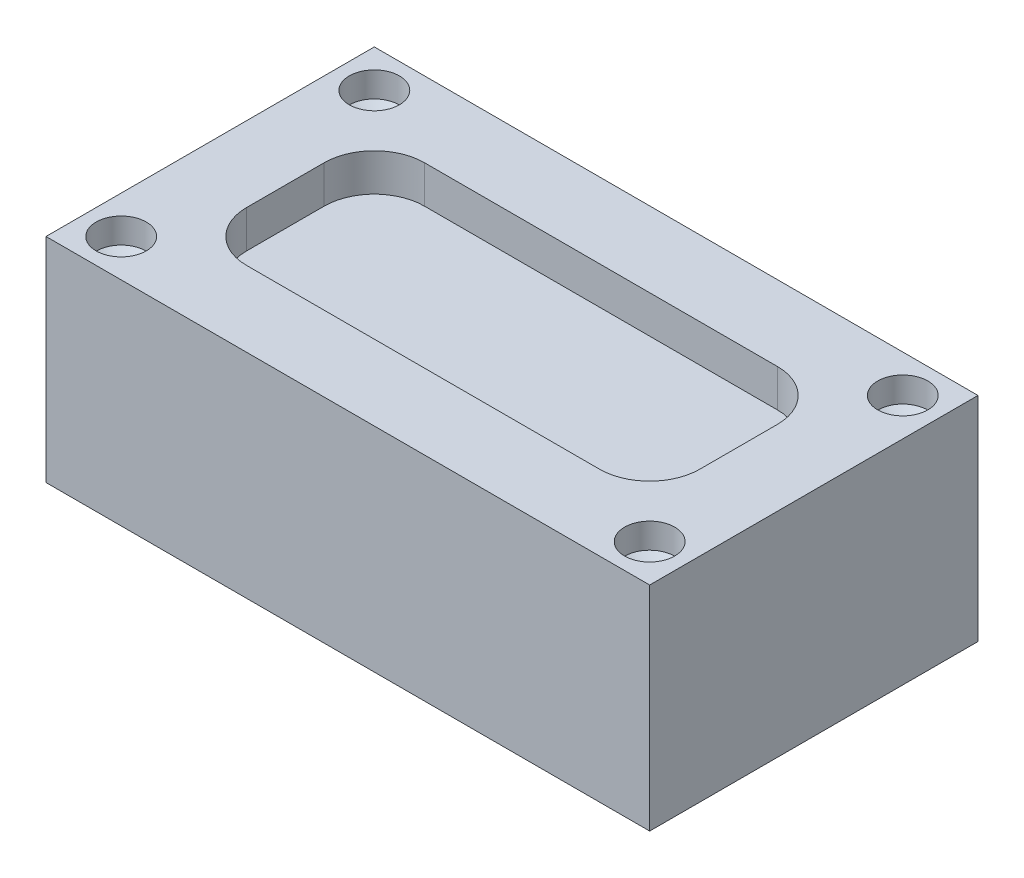
ISO-10303-21;
HEADER;
FILE_DESCRIPTION(('STEP AP214'),'2;1');
FILE_NAME('part.step','',(''),(''),'','','');
FILE_SCHEMA(('AUTOMOTIVE_DESIGN { 1 0 10303 214 1 1 1 1 }'));
ENDSEC;
DATA;
#1=APPLICATION_CONTEXT('core data for automotive mechanical design processes');
#2=APPLICATION_PROTOCOL_DEFINITION('international standard','automotive_design',2000,#1);
#3=PRODUCT_CONTEXT('',#1,'mechanical');
#4=PRODUCT('Part','Part','',(#3));
#5=PRODUCT_RELATED_PRODUCT_CATEGORY('part','',(#4));
#6=PRODUCT_DEFINITION_FORMATION('','',#4);
#7=PRODUCT_DEFINITION_CONTEXT('part definition',#1,'design');
#8=PRODUCT_DEFINITION('design','',#6,#7);
#9=PRODUCT_DEFINITION_SHAPE('','',#8);
#10=(LENGTH_UNIT() NAMED_UNIT(*) SI_UNIT(.MILLI.,.METRE.));
#11=(NAMED_UNIT(*) PLANE_ANGLE_UNIT() SI_UNIT($,.RADIAN.));
#12=(NAMED_UNIT(*) SI_UNIT($,.STERADIAN.) SOLID_ANGLE_UNIT());
#13=UNCERTAINTY_MEASURE_WITH_UNIT(LENGTH_MEASURE(1.E-05),#10,'distance_accuracy_value','');
#14=(GEOMETRIC_REPRESENTATION_CONTEXT(3) GLOBAL_UNCERTAINTY_ASSIGNED_CONTEXT((#13)) GLOBAL_UNIT_ASSIGNED_CONTEXT((#10,
#11,#12)) REPRESENTATION_CONTEXT('',''));
#15=CARTESIAN_POINT('',(0.,0.,0.));
#16=DIRECTION('',(0.,0.,1.));
#17=DIRECTION('',(1.,0.,0.));
#18=AXIS2_PLACEMENT_3D('',#15,#16,#17);
#19=CARTESIAN_POINT('',(120.382671357333,85.,65.4738352375261));
#20=DIRECTION('',(-1.,0.,0.));
#21=DIRECTION('',(0.,0.,1.));
#22=AXIS2_PLACEMENT_3D('',#19,#20,#21);
#23=PLANE('',#22);
#24=DIRECTION('',(0.,0.,-1.));
#25=VECTOR('',#24,1.);
#26=CARTESIAN_POINT('',(120.382671357333,0.,65.4738352375261));
#27=LINE('',#26,#25);
#28=CARTESIAN_POINT('',(120.382671357333,0.,65.4738352375261));
#29=VERTEX_POINT('',#28);
#30=CARTESIAN_POINT('',(120.382671357333,0.,-65.4738352375261));
#31=VERTEX_POINT('',#30);
#32=EDGE_CURVE('E181',#29,#31,#27,.T.);
#33=ORIENTED_EDGE('',*,*,#32,.T.);
#34=DIRECTION('',(0.,-1.,0.));
#35=VECTOR('',#34,1.);
#36=CARTESIAN_POINT('',(120.382671357333,85.,-65.4738352375261));
#37=LINE('',#36,#35);
#38=CARTESIAN_POINT('',(120.382671357333,85.,-65.4738352375261));
#39=VERTEX_POINT('',#38);
#40=EDGE_CURVE('E217',#39,#31,#37,.T.);
#41=ORIENTED_EDGE('',*,*,#40,.F.);
#42=DIRECTION('',(0.,0.,-1.));
#43=VECTOR('',#42,1.);
#44=CARTESIAN_POINT('',(120.382671357333,85.,65.4738352375261));
#45=LINE('',#44,#43);
#46=CARTESIAN_POINT('',(120.382671357333,85.,65.4738352375261));
#47=VERTEX_POINT('',#46);
#48=EDGE_CURVE('E191',#47,#39,#45,.T.);
#49=ORIENTED_EDGE('',*,*,#48,.F.);
#50=DIRECTION('',(0.,-1.,0.));
#51=VECTOR('',#50,1.);
#52=CARTESIAN_POINT('',(120.382671357333,85.,65.4738352375261));
#53=LINE('',#52,#51);
#54=EDGE_CURVE('E201',#47,#29,#53,.T.);
#55=ORIENTED_EDGE('',*,*,#54,.T.);
#56=EDGE_LOOP('',(#33,#41,#49,#55));
#57=FACE_BOUND('',#56,.T.);
#58=ADVANCED_FACE('F36',(#57),#23,.F.);
#59=CARTESIAN_POINT('',(-120.382671357333,85.,-65.4738352375261));
#60=DIRECTION('',(0.,0.,1.));
#61=DIRECTION('',(1.,0.,0.));
#62=AXIS2_PLACEMENT_3D('',#59,#60,#61);
#63=PLANE('',#62);
#64=DIRECTION('',(-1.,0.,0.));
#65=VECTOR('',#64,1.);
#66=CARTESIAN_POINT('',(-120.382671357333,0.,-65.4738352375261));
#67=LINE('',#66,#65);
#68=CARTESIAN_POINT('',(-120.382671357333,0.,-65.4738352375261));
#69=VERTEX_POINT('',#68);
#70=EDGE_CURVE('E204',#31,#69,#67,.T.);
#71=ORIENTED_EDGE('',*,*,#70,.T.);
#72=DIRECTION('',(0.,-1.,0.));
#73=VECTOR('',#72,1.);
#74=CARTESIAN_POINT('',(-120.382671357333,85.,-65.4738352375261));
#75=LINE('',#74,#73);
#76=CARTESIAN_POINT('',(-120.382671357333,85.,-65.4738352375261));
#77=VERTEX_POINT('',#76);
#78=EDGE_CURVE('E214',#77,#69,#75,.T.);
#79=ORIENTED_EDGE('',*,*,#78,.F.);
#80=DIRECTION('',(-1.,0.,0.));
#81=VECTOR('',#80,1.);
#82=CARTESIAN_POINT('',(-120.382671357333,85.,-65.4738352375261));
#83=LINE('',#82,#81);
#84=EDGE_CURVE('E194',#39,#77,#83,.T.);
#85=ORIENTED_EDGE('',*,*,#84,.F.);
#86=ORIENTED_EDGE('',*,*,#40,.T.);
#87=EDGE_LOOP('',(#71,#79,#85,#86));
#88=FACE_BOUND('',#87,.T.);
#89=ADVANCED_FACE('F292',(#88),#63,.F.);
#90=CARTESIAN_POINT('',(-120.382671357333,85.,65.4738352375261));
#91=DIRECTION('',(1.,0.,0.));
#92=DIRECTION('',(0.,0.,-1.));
#93=AXIS2_PLACEMENT_3D('',#90,#91,#92);
#94=PLANE('',#93);
#95=DIRECTION('',(0.,0.,1.));
#96=VECTOR('',#95,1.);
#97=CARTESIAN_POINT('',(-120.382671357333,0.,65.4738352375261));
#98=LINE('',#97,#96);
#99=CARTESIAN_POINT('',(-120.382671357333,0.,65.4738352375261));
#100=VERTEX_POINT('',#99);
#101=EDGE_CURVE('E206',#69,#100,#98,.T.);
#102=ORIENTED_EDGE('',*,*,#101,.T.);
#103=DIRECTION('',(0.,-1.,0.));
#104=VECTOR('',#103,1.);
#105=CARTESIAN_POINT('',(-120.382671357333,85.,65.4738352375261));
#106=LINE('',#105,#104);
#107=CARTESIAN_POINT('',(-120.382671357333,85.,65.4738352375261));
#108=VERTEX_POINT('',#107);
#109=EDGE_CURVE('E211',#108,#100,#106,.T.);
#110=ORIENTED_EDGE('',*,*,#109,.F.);
#111=DIRECTION('',(0.,0.,1.));
#112=VECTOR('',#111,1.);
#113=CARTESIAN_POINT('',(-120.382671357333,85.,65.4738352375261));
#114=LINE('',#113,#112);
#115=EDGE_CURVE('E197',#77,#108,#114,.T.);
#116=ORIENTED_EDGE('',*,*,#115,.F.);
#117=ORIENTED_EDGE('',*,*,#78,.T.);
#118=EDGE_LOOP('',(#102,#110,#116,#117));
#119=FACE_BOUND('',#118,.T.);
#120=ADVANCED_FACE('F298',(#119),#94,.F.);
#121=CARTESIAN_POINT('',(-120.382671357333,85.,65.4738352375261));
#122=DIRECTION('',(0.,0.,-1.));
#123=DIRECTION('',(-1.,0.,0.));
#124=AXIS2_PLACEMENT_3D('',#121,#122,#123);
#125=PLANE('',#124);
#126=DIRECTION('',(1.,0.,0.));
#127=VECTOR('',#126,1.);
#128=CARTESIAN_POINT('',(-120.382671357333,0.,65.4738352375261));
#129=LINE('',#128,#127);
#130=EDGE_CURVE('E195',#100,#29,#129,.T.);
#131=ORIENTED_EDGE('',*,*,#130,.T.);
#132=ORIENTED_EDGE('',*,*,#54,.F.);
#133=DIRECTION('',(1.,0.,0.));
#134=VECTOR('',#133,1.);
#135=CARTESIAN_POINT('',(-120.382671357333,85.,65.4738352375261));
#136=LINE('',#135,#134);
#137=EDGE_CURVE('E199',#108,#47,#136,.T.);
#138=ORIENTED_EDGE('',*,*,#137,.F.);
#139=ORIENTED_EDGE('',*,*,#109,.T.);
#140=EDGE_LOOP('',(#131,#132,#138,#139));
#141=FACE_BOUND('',#140,.T.);
#142=ADVANCED_FACE('F304',(#141),#125,.F.);
#143=CARTESIAN_POINT('',(0.,85.,0.));
#144=DIRECTION('',(0.,-1.,0.));
#145=DIRECTION('',(0.,0.,-1.));
#146=AXIS2_PLACEMENT_3D('',#143,#144,#145);
#147=PLANE('',#146);
#148=CARTESIAN_POINT('',(-105.382671357333,85.,-50.4738352375261));
#149=DIRECTION('',(0.,1.,0.));
#150=DIRECTION('',(0.,0.,1.));
#151=AXIS2_PLACEMENT_3D('',#148,#149,#150);
#152=CIRCLE('',#151,9.99999999999999);
#153=CARTESIAN_POINT('',(-105.382671357333,85.,-40.4738352375262));
#154=VERTEX_POINT('',#153);
#155=EDGE_CURVE('E145',#154,#154,#152,.T.);
#156=ORIENTED_EDGE('',*,*,#155,.F.);
#157=EDGE_LOOP('',(#156));
#158=FACE_BOUND('',#157,.T.);
#159=CARTESIAN_POINT('',(-105.382671357333,85.,50.4738352375261));
#160=DIRECTION('',(0.,1.,0.));
#161=DIRECTION('',(0.,0.,1.));
#162=AXIS2_PLACEMENT_3D('',#159,#160,#161);
#163=CIRCLE('',#162,9.99999999999999);
#164=CARTESIAN_POINT('',(-105.382671357333,85.,60.4738352375261));
#165=VERTEX_POINT('',#164);
#166=EDGE_CURVE('E144',#165,#165,#163,.T.);
#167=ORIENTED_EDGE('',*,*,#166,.F.);
#168=EDGE_LOOP('',(#167));
#169=FACE_BOUND('',#168,.T.);
#170=CARTESIAN_POINT('',(105.382671357333,85.,-50.4738352375261));
#171=DIRECTION('',(0.,1.,0.));
#172=DIRECTION('',(0.,0.,1.));
#173=AXIS2_PLACEMENT_3D('',#170,#171,#172);
#174=CIRCLE('',#173,9.99999999999999);
#175=CARTESIAN_POINT('',(105.382671357333,85.,-40.4738352375262));
#176=VERTEX_POINT('',#175);
#177=EDGE_CURVE('E155',#176,#176,#174,.T.);
#178=ORIENTED_EDGE('',*,*,#177,.F.);
#179=EDGE_LOOP('',(#178));
#180=FACE_BOUND('',#179,.T.);
#181=CARTESIAN_POINT('',(105.382671357333,85.,50.4738352375261));
#182=DIRECTION('',(0.,1.,0.));
#183=DIRECTION('',(0.,0.,1.));
#184=AXIS2_PLACEMENT_3D('',#181,#182,#183);
#185=CIRCLE('',#184,9.99999999999999);
#186=CARTESIAN_POINT('',(105.382671357333,85.,60.4738352375261));
#187=VERTEX_POINT('',#186);
#188=EDGE_CURVE('E161',#187,#187,#185,.T.);
#189=ORIENTED_EDGE('',*,*,#188,.F.);
#190=EDGE_LOOP('',(#189));
#191=FACE_BOUND('',#190,.T.);
#192=DIRECTION('',(0.,0.,-1.));
#193=VECTOR('',#192,1.);
#194=CARTESIAN_POINT('',(90.3826713573335,85.,35.4738352375261));
#195=LINE('',#194,#193);
#196=CARTESIAN_POINT('',(90.3826713573335,85.,15.4738352375261));
#197=VERTEX_POINT('',#196);
#198=CARTESIAN_POINT('',(90.3826713573335,85.,-15.4738352375261));
#199=VERTEX_POINT('',#198);
#200=EDGE_CURVE('E184',#197,#199,#195,.T.);
#201=ORIENTED_EDGE('',*,*,#200,.F.);
#202=CARTESIAN_POINT('',(70.3826713573335,85.,15.4738352375261));
#203=DIRECTION('',(0.,-1.,0.));
#204=DIRECTION('',(0.,0.,-1.));
#205=AXIS2_PLACEMENT_3D('',#202,#203,#204);
#206=CIRCLE('',#205,20.);
#207=CARTESIAN_POINT('',(70.3826713573335,85.,35.4738352375261));
#208=VERTEX_POINT('',#207);
#209=EDGE_CURVE('E249',#197,#208,#206,.T.);
#210=ORIENTED_EDGE('',*,*,#209,.T.);
#211=DIRECTION('',(1.,0.,0.));
#212=VECTOR('',#211,1.);
#213=CARTESIAN_POINT('',(-90.3826713573335,85.,35.4738352375261));
#214=LINE('',#213,#212);
#215=CARTESIAN_POINT('',(-70.3826713573335,85.,35.4738352375261));
#216=VERTEX_POINT('',#215);
#217=EDGE_CURVE('E167',#216,#208,#214,.T.);
#218=ORIENTED_EDGE('',*,*,#217,.F.);
#219=CARTESIAN_POINT('',(-70.3826713573335,85.,15.4738352375261));
#220=DIRECTION('',(0.,-1.,0.));
#221=DIRECTION('',(0.,0.,-1.));
#222=AXIS2_PLACEMENT_3D('',#219,#220,#221);
#223=CIRCLE('',#222,20.);
#224=CARTESIAN_POINT('',(-90.3826713573335,85.,15.4738352375261));
#225=VERTEX_POINT('',#224);
#226=EDGE_CURVE('E247',#216,#225,#223,.T.);
#227=ORIENTED_EDGE('',*,*,#226,.T.);
#228=DIRECTION('',(0.,0.,1.));
#229=VECTOR('',#228,1.);
#230=CARTESIAN_POINT('',(-90.3826713573335,85.,-35.4738352375261));
#231=LINE('',#230,#229);
#232=CARTESIAN_POINT('',(-90.3826713573335,85.,-15.4738352375261));
#233=VERTEX_POINT('',#232);
#234=EDGE_CURVE('E172',#233,#225,#231,.T.);
#235=ORIENTED_EDGE('',*,*,#234,.F.);
#236=CARTESIAN_POINT('',(-70.3826713573335,85.,-15.4738352375261));
#237=DIRECTION('',(0.,-1.,0.));
#238=DIRECTION('',(0.,0.,-1.));
#239=AXIS2_PLACEMENT_3D('',#236,#237,#238);
#240=CIRCLE('',#239,20.);
#241=CARTESIAN_POINT('',(-70.3826713573335,85.,-35.4738352375261));
#242=VERTEX_POINT('',#241);
#243=EDGE_CURVE('E11',#233,#242,#240,.T.);
#244=ORIENTED_EDGE('',*,*,#243,.T.);
#245=DIRECTION('',(-1.,0.,0.));
#246=VECTOR('',#245,1.);
#247=CARTESIAN_POINT('',(90.3826713573335,85.,-35.4738352375261));
#248=LINE('',#247,#246);
#249=CARTESIAN_POINT('',(70.3826713573335,85.,-35.4738352375261));
#250=VERTEX_POINT('',#249);
#251=EDGE_CURVE('E187',#250,#242,#248,.T.);
#252=ORIENTED_EDGE('',*,*,#251,.F.);
#253=CARTESIAN_POINT('',(70.3826713573335,85.,-15.4738352375261));
#254=DIRECTION('',(0.,-1.,0.));
#255=DIRECTION('',(0.,0.,-1.));
#256=AXIS2_PLACEMENT_3D('',#253,#254,#255);
#257=CIRCLE('',#256,20.);
#258=EDGE_CURVE('E44',#250,#199,#257,.T.);
#259=ORIENTED_EDGE('',*,*,#258,.T.);
#260=EDGE_LOOP('',(#201,#210,#218,#227,#235,#244,#252,#259));
#261=FACE_BOUND('',#260,.T.);
#262=ORIENTED_EDGE('',*,*,#48,.T.);
#263=ORIENTED_EDGE('',*,*,#84,.T.);
#264=ORIENTED_EDGE('',*,*,#115,.T.);
#265=ORIENTED_EDGE('',*,*,#137,.T.);
#266=EDGE_LOOP('',(#262,#263,#264,#265));
#267=FACE_BOUND('',#266,.T.);
#268=ADVANCED_FACE('F251',(#158,#169,#180,#191,#261,#267),#147,.F.);
#269=CARTESIAN_POINT('',(0.,0.,0.));
#270=DIRECTION('',(0.,-1.,0.));
#271=DIRECTION('',(0.,0.,-1.));
#272=AXIS2_PLACEMENT_3D('',#269,#270,#271);
#273=PLANE('',#272);
#274=ORIENTED_EDGE('',*,*,#32,.F.);
#275=ORIENTED_EDGE('',*,*,#130,.F.);
#276=ORIENTED_EDGE('',*,*,#101,.F.);
#277=ORIENTED_EDGE('',*,*,#70,.F.);
#278=EDGE_LOOP('',(#274,#275,#276,#277));
#279=FACE_BOUND('',#278,.T.);
#280=ADVANCED_FACE('F309',(#279),#273,.T.);
#281=CARTESIAN_POINT('',(-90.3826713573335,70.,35.4738352375261));
#282=DIRECTION('',(0.,0.,1.));
#283=DIRECTION('',(1.,0.,0.));
#284=AXIS2_PLACEMENT_3D('',#281,#282,#283);
#285=PLANE('',#284);
#286=DIRECTION('',(1.,0.,0.));
#287=VECTOR('',#286,1.);
#288=CARTESIAN_POINT('',(-90.3826713573335,70.,35.4738352375261));
#289=LINE('',#288,#287);
#290=CARTESIAN_POINT('',(-70.3826713573335,70.,35.4738352375261));
#291=VERTEX_POINT('',#290);
#292=CARTESIAN_POINT('',(70.3826713573335,70.,35.4738352375261));
#293=VERTEX_POINT('',#292);
#294=EDGE_CURVE('E168',#291,#293,#289,.T.);
#295=ORIENTED_EDGE('',*,*,#294,.F.);
#296=DIRECTION('',(0.,1.,0.));
#297=VECTOR('',#296,1.);
#298=CARTESIAN_POINT('',(-70.3826713573335,85.,35.4738352375261));
#299=LINE('',#298,#297);
#300=EDGE_CURVE('E222',#291,#216,#299,.T.);
#301=ORIENTED_EDGE('',*,*,#300,.T.);
#302=ORIENTED_EDGE('',*,*,#217,.T.);
#303=DIRECTION('',(0.,1.,0.));
#304=VECTOR('',#303,1.);
#305=CARTESIAN_POINT('',(70.3826713573335,70.,35.4738352375261));
#306=LINE('',#305,#304);
#307=EDGE_CURVE('E220',#208,#293,#306,.F.);
#308=ORIENTED_EDGE('',*,*,#307,.T.);
#309=EDGE_LOOP('',(#295,#301,#302,#308));
#310=FACE_BOUND('',#309,.T.);
#311=ADVANCED_FACE('F279',(#310),#285,.F.);
#312=CARTESIAN_POINT('',(-90.3826713573335,70.,-35.4738352375261));
#313=DIRECTION('',(-1.,0.,0.));
#314=DIRECTION('',(0.,0.,1.));
#315=AXIS2_PLACEMENT_3D('',#312,#313,#314);
#316=PLANE('',#315);
#317=ORIENTED_EDGE('',*,*,#234,.T.);
#318=DIRECTION('',(0.,1.,0.));
#319=VECTOR('',#318,1.);
#320=CARTESIAN_POINT('',(-90.3826713573335,70.,15.4738352375261));
#321=LINE('',#320,#319);
#322=CARTESIAN_POINT('',(-90.3826713573335,70.,15.4738352375261));
#323=VERTEX_POINT('',#322);
#324=EDGE_CURVE('E228',#225,#323,#321,.F.);
#325=ORIENTED_EDGE('',*,*,#324,.T.);
#326=DIRECTION('',(0.,0.,1.));
#327=VECTOR('',#326,1.);
#328=CARTESIAN_POINT('',(-90.3826713573335,70.,-35.4738352375261));
#329=LINE('',#328,#327);
#330=CARTESIAN_POINT('',(-90.3826713573335,70.,-15.4738352375261));
#331=VERTEX_POINT('',#330);
#332=EDGE_CURVE('E178',#331,#323,#329,.T.);
#333=ORIENTED_EDGE('',*,*,#332,.F.);
#334=DIRECTION('',(0.,1.,0.));
#335=VECTOR('',#334,1.);
#336=CARTESIAN_POINT('',(-90.3826713573335,85.,-15.4738352375261));
#337=LINE('',#336,#335);
#338=EDGE_CURVE('E225',#331,#233,#337,.T.);
#339=ORIENTED_EDGE('',*,*,#338,.T.);
#340=EDGE_LOOP('',(#317,#325,#333,#339));
#341=FACE_BOUND('',#340,.T.);
#342=ADVANCED_FACE('F271',(#341),#316,.F.);
#343=CARTESIAN_POINT('',(90.3826713573335,70.,-35.4738352375261));
#344=DIRECTION('',(0.,0.,-1.));
#345=DIRECTION('',(-1.,0.,0.));
#346=AXIS2_PLACEMENT_3D('',#343,#344,#345);
#347=PLANE('',#346);
#348=DIRECTION('',(-1.,0.,0.));
#349=VECTOR('',#348,1.);
#350=CARTESIAN_POINT('',(90.3826713573335,70.,-35.4738352375261));
#351=LINE('',#350,#349);
#352=CARTESIAN_POINT('',(70.3826713573335,70.,-35.4738352375261));
#353=VERTEX_POINT('',#352);
#354=CARTESIAN_POINT('',(-70.3826713573335,70.,-35.4738352375261));
#355=VERTEX_POINT('',#354);
#356=EDGE_CURVE('E175',#353,#355,#351,.T.);
#357=ORIENTED_EDGE('',*,*,#356,.F.);
#358=DIRECTION('',(0.,1.,0.));
#359=VECTOR('',#358,1.);
#360=CARTESIAN_POINT('',(70.3826713573335,85.,-35.4738352375261));
#361=LINE('',#360,#359);
#362=EDGE_CURVE('E245',#353,#250,#361,.T.);
#363=ORIENTED_EDGE('',*,*,#362,.T.);
#364=ORIENTED_EDGE('',*,*,#251,.T.);
#365=DIRECTION('',(0.,1.,0.));
#366=VECTOR('',#365,1.);
#367=CARTESIAN_POINT('',(-70.3826713573335,70.,-35.4738352375261));
#368=LINE('',#367,#366);
#369=EDGE_CURVE('E243',#242,#355,#368,.F.);
#370=ORIENTED_EDGE('',*,*,#369,.T.);
#371=EDGE_LOOP('',(#357,#363,#364,#370));
#372=FACE_BOUND('',#371,.T.);
#373=ADVANCED_FACE('F264',(#372),#347,.F.);
#374=CARTESIAN_POINT('',(90.3826713573335,70.,35.4738352375261));
#375=DIRECTION('',(1.,0.,0.));
#376=DIRECTION('',(0.,0.,-1.));
#377=AXIS2_PLACEMENT_3D('',#374,#375,#376);
#378=PLANE('',#377);
#379=DIRECTION('',(0.,0.,-1.));
#380=VECTOR('',#379,1.);
#381=CARTESIAN_POINT('',(90.3826713573335,70.,35.4738352375261));
#382=LINE('',#381,#380);
#383=CARTESIAN_POINT('',(90.3826713573335,70.,15.4738352375261));
#384=VERTEX_POINT('',#383);
#385=CARTESIAN_POINT('',(90.3826713573335,70.,-15.4738352375261));
#386=VERTEX_POINT('',#385);
#387=EDGE_CURVE('E171',#384,#386,#382,.T.);
#388=ORIENTED_EDGE('',*,*,#387,.F.);
#389=DIRECTION('',(0.,1.,0.));
#390=VECTOR('',#389,1.);
#391=CARTESIAN_POINT('',(90.3826713573335,85.,15.4738352375261));
#392=LINE('',#391,#390);
#393=EDGE_CURVE('E240',#384,#197,#392,.T.);
#394=ORIENTED_EDGE('',*,*,#393,.T.);
#395=ORIENTED_EDGE('',*,*,#200,.T.);
#396=DIRECTION('',(0.,1.,0.));
#397=VECTOR('',#396,1.);
#398=CARTESIAN_POINT('',(90.3826713573335,70.,-15.4738352375261));
#399=LINE('',#398,#397);
#400=EDGE_CURVE('E238',#199,#386,#399,.F.);
#401=ORIENTED_EDGE('',*,*,#400,.T.);
#402=EDGE_LOOP('',(#388,#394,#395,#401));
#403=FACE_BOUND('',#402,.T.);
#404=ADVANCED_FACE('F255',(#403),#378,.F.);
#405=CARTESIAN_POINT('',(0.,70.,0.));
#406=DIRECTION('',(0.,1.,0.));
#407=DIRECTION('',(0.,0.,1.));
#408=AXIS2_PLACEMENT_3D('',#405,#406,#407);
#409=PLANE('',#408);
#410=ORIENTED_EDGE('',*,*,#332,.T.);
#411=CARTESIAN_POINT('',(-70.3826713573335,70.,15.4738352375261));
#412=DIRECTION('',(0.,1.,0.));
#413=DIRECTION('',(0.,0.,1.));
#414=AXIS2_PLACEMENT_3D('',#411,#412,#413);
#415=CIRCLE('',#414,20.);
#416=EDGE_CURVE('E236',#323,#291,#415,.T.);
#417=ORIENTED_EDGE('',*,*,#416,.T.);
#418=ORIENTED_EDGE('',*,*,#294,.T.);
#419=CARTESIAN_POINT('',(70.3826713573335,70.,15.4738352375261));
#420=DIRECTION('',(0.,1.,0.));
#421=DIRECTION('',(0.,0.,1.));
#422=AXIS2_PLACEMENT_3D('',#419,#420,#421);
#423=CIRCLE('',#422,20.);
#424=EDGE_CURVE('E234',#293,#384,#423,.T.);
#425=ORIENTED_EDGE('',*,*,#424,.T.);
#426=ORIENTED_EDGE('',*,*,#387,.T.);
#427=CARTESIAN_POINT('',(70.3826713573335,70.,-15.4738352375261));
#428=DIRECTION('',(0.,1.,0.));
#429=DIRECTION('',(0.,0.,1.));
#430=AXIS2_PLACEMENT_3D('',#427,#428,#429);
#431=CIRCLE('',#430,20.);
#432=EDGE_CURVE('E232',#386,#353,#431,.T.);
#433=ORIENTED_EDGE('',*,*,#432,.T.);
#434=ORIENTED_EDGE('',*,*,#356,.T.);
#435=CARTESIAN_POINT('',(-70.3826713573335,70.,-15.4738352375261));
#436=DIRECTION('',(0.,1.,0.));
#437=DIRECTION('',(0.,0.,1.));
#438=AXIS2_PLACEMENT_3D('',#435,#436,#437);
#439=CIRCLE('',#438,20.);
#440=EDGE_CURVE('E230',#355,#331,#439,.T.);
#441=ORIENTED_EDGE('',*,*,#440,.T.);
#442=EDGE_LOOP('',(#410,#417,#418,#425,#426,#433,#434,#441));
#443=FACE_BOUND('',#442,.T.);
#444=ADVANCED_FACE('F261',(#443),#409,.T.);
#445=CARTESIAN_POINT('',(105.382671357333,74.95,50.4738352375261));
#446=DIRECTION('',(0.,1.,0.));
#447=DIRECTION('',(0.,0.,1.));
#448=AXIS2_PLACEMENT_3D('',#445,#446,#447);
#449=CONICAL_SURFACE('',#448,9.99999999999999,1.02974425867665);
#450=CARTESIAN_POINT('',(105.382671357333,68.9413938097244,50.4738352375261));
#451=VERTEX_POINT('',#450);
#452=VERTEX_LOOP('',#451);
#453=FACE_BOUND('',#452,.T.);
#454=CARTESIAN_POINT('',(105.382671357333,74.95,50.4738352375261));
#455=DIRECTION('',(0.,1.,0.));
#456=DIRECTION('',(0.,0.,1.));
#457=AXIS2_PLACEMENT_3D('',#454,#455,#456);
#458=CIRCLE('',#457,9.99999999999999);
#459=CARTESIAN_POINT('',(105.382671357333,74.95,60.4738352375261));
#460=VERTEX_POINT('',#459);
#461=EDGE_CURVE('E164',#460,#460,#458,.T.);
#462=ORIENTED_EDGE('',*,*,#461,.T.);
#463=EDGE_LOOP('',(#462));
#464=FACE_BOUND('',#463,.T.);
#465=ADVANCED_FACE('F326',(#453,#464),#449,.F.);
#466=CARTESIAN_POINT('',(105.382671357333,85.,50.4738352375261));
#467=DIRECTION('',(0.,1.,0.));
#468=DIRECTION('',(0.,0.,1.));
#469=AXIS2_PLACEMENT_3D('',#466,#467,#468);
#470=CYLINDRICAL_SURFACE('',#469,9.99999999999999);
#471=ORIENTED_EDGE('',*,*,#461,.F.);
#472=EDGE_LOOP('',(#471));
#473=FACE_BOUND('',#472,.T.);
#474=ORIENTED_EDGE('',*,*,#188,.T.);
#475=EDGE_LOOP('',(#474));
#476=FACE_BOUND('',#475,.T.);
#477=ADVANCED_FACE('F329',(#473,#476),#470,.F.);
#478=CARTESIAN_POINT('',(105.382671357333,74.95,-50.4738352375261));
#479=DIRECTION('',(0.,1.,0.));
#480=DIRECTION('',(0.,0.,1.));
#481=AXIS2_PLACEMENT_3D('',#478,#479,#480);
#482=CONICAL_SURFACE('',#481,9.99999999999999,1.02974425867665);
#483=CARTESIAN_POINT('',(105.382671357333,68.9413938097244,-50.4738352375261));
#484=VERTEX_POINT('',#483);
#485=VERTEX_LOOP('',#484);
#486=FACE_BOUND('',#485,.T.);
#487=CARTESIAN_POINT('',(105.382671357333,74.95,-50.4738352375261));
#488=DIRECTION('',(0.,1.,0.));
#489=DIRECTION('',(0.,0.,1.));
#490=AXIS2_PLACEMENT_3D('',#487,#488,#489);
#491=CIRCLE('',#490,9.99999999999999);
#492=CARTESIAN_POINT('',(105.382671357333,74.95,-40.4738352375262));
#493=VERTEX_POINT('',#492);
#494=EDGE_CURVE('E158',#493,#493,#491,.T.);
#495=ORIENTED_EDGE('',*,*,#494,.T.);
#496=EDGE_LOOP('',(#495));
#497=FACE_BOUND('',#496,.T.);
#498=ADVANCED_FACE('F333',(#486,#497),#482,.F.);
#499=CARTESIAN_POINT('',(105.382671357333,85.,-50.4738352375261));
#500=DIRECTION('',(0.,1.,0.));
#501=DIRECTION('',(0.,0.,1.));
#502=AXIS2_PLACEMENT_3D('',#499,#500,#501);
#503=CYLINDRICAL_SURFACE('',#502,9.99999999999999);
#504=ORIENTED_EDGE('',*,*,#494,.F.);
#505=EDGE_LOOP('',(#504));
#506=FACE_BOUND('',#505,.T.);
#507=ORIENTED_EDGE('',*,*,#177,.T.);
#508=EDGE_LOOP('',(#507));
#509=FACE_BOUND('',#508,.T.);
#510=ADVANCED_FACE('F337',(#506,#509),#503,.F.);
#511=CARTESIAN_POINT('',(-105.382671357333,74.95,50.4738352375261));
#512=DIRECTION('',(0.,1.,0.));
#513=DIRECTION('',(0.,0.,1.));
#514=AXIS2_PLACEMENT_3D('',#511,#512,#513);
#515=CONICAL_SURFACE('',#514,9.99999999999999,1.02974425867665);
#516=CARTESIAN_POINT('',(-105.382671357333,68.9413938097244,50.4738352375261));
#517=VERTEX_POINT('',#516);
#518=VERTEX_LOOP('',#517);
#519=FACE_BOUND('',#518,.T.);
#520=CARTESIAN_POINT('',(-105.382671357333,74.95,50.4738352375261));
#521=DIRECTION('',(0.,1.,0.));
#522=DIRECTION('',(0.,0.,1.));
#523=AXIS2_PLACEMENT_3D('',#520,#521,#522);
#524=CIRCLE('',#523,9.99999999999999);
#525=CARTESIAN_POINT('',(-105.382671357333,74.95,60.4738352375261));
#526=VERTEX_POINT('',#525);
#527=EDGE_CURVE('E148',#526,#526,#524,.T.);
#528=ORIENTED_EDGE('',*,*,#527,.T.);
#529=EDGE_LOOP('',(#528));
#530=FACE_BOUND('',#529,.T.);
#531=ADVANCED_FACE('F341',(#519,#530),#515,.F.);
#532=CARTESIAN_POINT('',(-105.382671357333,85.,50.4738352375261));
#533=DIRECTION('',(0.,1.,0.));
#534=DIRECTION('',(0.,0.,1.));
#535=AXIS2_PLACEMENT_3D('',#532,#533,#534);
#536=CYLINDRICAL_SURFACE('',#535,9.99999999999999);
#537=ORIENTED_EDGE('',*,*,#527,.F.);
#538=EDGE_LOOP('',(#537));
#539=FACE_BOUND('',#538,.T.);
#540=ORIENTED_EDGE('',*,*,#166,.T.);
#541=EDGE_LOOP('',(#540));
#542=FACE_BOUND('',#541,.T.);
#543=ADVANCED_FACE('F138',(#539,#542),#536,.F.);
#544=CARTESIAN_POINT('',(-105.382671357333,74.95,-50.4738352375261));
#545=DIRECTION('',(0.,1.,0.));
#546=DIRECTION('',(0.,0.,1.));
#547=AXIS2_PLACEMENT_3D('',#544,#545,#546);
#548=CONICAL_SURFACE('',#547,9.99999999999999,1.02974425867665);
#549=CARTESIAN_POINT('',(-105.382671357333,68.9413938097244,-50.4738352375261));
#550=VERTEX_POINT('',#549);
#551=VERTEX_LOOP('',#550);
#552=FACE_BOUND('',#551,.T.);
#553=CARTESIAN_POINT('',(-105.382671357333,74.95,-50.4738352375261));
#554=DIRECTION('',(0.,1.,0.));
#555=DIRECTION('',(0.,0.,1.));
#556=AXIS2_PLACEMENT_3D('',#553,#554,#555);
#557=CIRCLE('',#556,9.99999999999999);
#558=CARTESIAN_POINT('',(-105.382671357333,74.95,-40.4738352375262));
#559=VERTEX_POINT('',#558);
#560=EDGE_CURVE('E142',#559,#559,#557,.T.);
#561=ORIENTED_EDGE('',*,*,#560,.T.);
#562=EDGE_LOOP('',(#561));
#563=FACE_BOUND('',#562,.T.);
#564=ADVANCED_FACE('F134',(#552,#563),#548,.F.);
#565=CARTESIAN_POINT('',(-105.382671357333,85.,-50.4738352375261));
#566=DIRECTION('',(0.,1.,0.));
#567=DIRECTION('',(0.,0.,1.));
#568=AXIS2_PLACEMENT_3D('',#565,#566,#567);
#569=CYLINDRICAL_SURFACE('',#568,9.99999999999999);
#570=ORIENTED_EDGE('',*,*,#560,.F.);
#571=EDGE_LOOP('',(#570));
#572=FACE_BOUND('',#571,.T.);
#573=ORIENTED_EDGE('',*,*,#155,.T.);
#574=EDGE_LOOP('',(#573));
#575=FACE_BOUND('',#574,.T.);
#576=ADVANCED_FACE('F137',(#572,#575),#569,.F.);
#577=CARTESIAN_POINT('',(-70.3826713573335,70.,15.4738352375261));
#578=DIRECTION('',(0.,-1.,0.));
#579=DIRECTION('',(0.,0.,-1.));
#580=AXIS2_PLACEMENT_3D('',#577,#578,#579);
#581=CYLINDRICAL_SURFACE('',#580,20.);
#582=ORIENTED_EDGE('',*,*,#416,.F.);
#583=ORIENTED_EDGE('',*,*,#324,.F.);
#584=ORIENTED_EDGE('',*,*,#226,.F.);
#585=ORIENTED_EDGE('',*,*,#300,.F.);
#586=EDGE_LOOP('',(#582,#583,#584,#585));
#587=FACE_BOUND('',#586,.T.);
#588=ADVANCED_FACE('F274',(#587),#581,.F.);
#589=CARTESIAN_POINT('',(70.3826713573335,70.,15.4738352375261));
#590=DIRECTION('',(0.,-1.,0.));
#591=DIRECTION('',(0.,0.,-1.));
#592=AXIS2_PLACEMENT_3D('',#589,#590,#591);
#593=CYLINDRICAL_SURFACE('',#592,20.);
#594=ORIENTED_EDGE('',*,*,#424,.F.);
#595=ORIENTED_EDGE('',*,*,#307,.F.);
#596=ORIENTED_EDGE('',*,*,#209,.F.);
#597=ORIENTED_EDGE('',*,*,#393,.F.);
#598=EDGE_LOOP('',(#594,#595,#596,#597));
#599=FACE_BOUND('',#598,.T.);
#600=ADVANCED_FACE('F283',(#599),#593,.F.);
#601=CARTESIAN_POINT('',(70.3826713573335,70.,-15.4738352375261));
#602=DIRECTION('',(0.,-1.,0.));
#603=DIRECTION('',(0.,0.,-1.));
#604=AXIS2_PLACEMENT_3D('',#601,#602,#603);
#605=CYLINDRICAL_SURFACE('',#604,20.);
#606=ORIENTED_EDGE('',*,*,#432,.F.);
#607=ORIENTED_EDGE('',*,*,#400,.F.);
#608=ORIENTED_EDGE('',*,*,#258,.F.);
#609=ORIENTED_EDGE('',*,*,#362,.F.);
#610=EDGE_LOOP('',(#606,#607,#608,#609));
#611=FACE_BOUND('',#610,.T.);
#612=ADVANCED_FACE('F258',(#611),#605,.F.);
#613=CARTESIAN_POINT('',(-70.3826713573335,70.,-15.4738352375261));
#614=DIRECTION('',(0.,-1.,0.));
#615=DIRECTION('',(0.,0.,-1.));
#616=AXIS2_PLACEMENT_3D('',#613,#614,#615);
#617=CYLINDRICAL_SURFACE('',#616,20.);
#618=ORIENTED_EDGE('',*,*,#440,.F.);
#619=ORIENTED_EDGE('',*,*,#369,.F.);
#620=ORIENTED_EDGE('',*,*,#243,.F.);
#621=ORIENTED_EDGE('',*,*,#338,.F.);
#622=EDGE_LOOP('',(#618,#619,#620,#621));
#623=FACE_BOUND('',#622,.T.);
#624=ADVANCED_FACE('F38',(#623),#617,.F.);
#625=CLOSED_SHELL('',(#58,#89,#120,#142,#268,#280,#311,#342,#373,#404,#444,#465,#477,#498,#510,
#531,#543,#564,#576,#588,#600,#612,#624));
#626=MANIFOLD_SOLID_BREP('B2',#625);
#627=ADVANCED_BREP_SHAPE_REPRESENTATION('',(#18,#626),#14);
#628=SHAPE_DEFINITION_REPRESENTATION(#9,#627);
ENDSEC;
END-ISO-10303-21;
